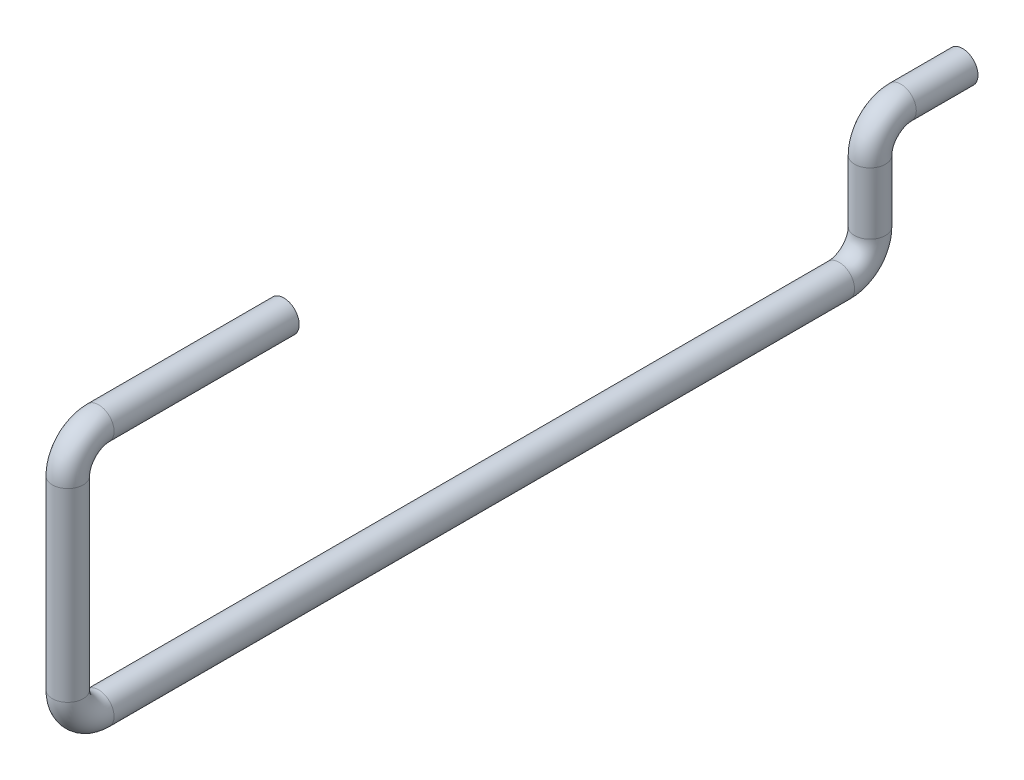
ISO-10303-21;
HEADER;
FILE_DESCRIPTION(('STEP AP214'),'2;1');
FILE_NAME('part.step','',(''),(''),'','','');
FILE_SCHEMA(('AUTOMOTIVE_DESIGN { 1 0 10303 214 1 1 1 1 }'));
ENDSEC;
DATA;
#1=APPLICATION_CONTEXT('core data for automotive mechanical design processes');
#2=APPLICATION_PROTOCOL_DEFINITION('international standard','automotive_design',2000,#1);
#3=PRODUCT_CONTEXT('',#1,'mechanical');
#4=PRODUCT('Part','Part','',(#3));
#5=PRODUCT_RELATED_PRODUCT_CATEGORY('part','',(#4));
#6=PRODUCT_DEFINITION_FORMATION('','',#4);
#7=PRODUCT_DEFINITION_CONTEXT('part definition',#1,'design');
#8=PRODUCT_DEFINITION('design','',#6,#7);
#9=PRODUCT_DEFINITION_SHAPE('','',#8);
#10=(LENGTH_UNIT() NAMED_UNIT(*) SI_UNIT(.MILLI.,.METRE.));
#11=(NAMED_UNIT(*) PLANE_ANGLE_UNIT() SI_UNIT($,.RADIAN.));
#12=(NAMED_UNIT(*) SI_UNIT($,.STERADIAN.) SOLID_ANGLE_UNIT());
#13=UNCERTAINTY_MEASURE_WITH_UNIT(LENGTH_MEASURE(1.E-05),#10,'distance_accuracy_value','');
#14=(GEOMETRIC_REPRESENTATION_CONTEXT(3) GLOBAL_UNCERTAINTY_ASSIGNED_CONTEXT((#13)) GLOBAL_UNIT_ASSIGNED_CONTEXT((#10,
#11,#12)) REPRESENTATION_CONTEXT('',''));
#15=CARTESIAN_POINT('',(0.,0.,0.));
#16=DIRECTION('',(0.,0.,1.));
#17=DIRECTION('',(1.,0.,0.));
#18=AXIS2_PLACEMENT_3D('',#15,#16,#17);
#19=CARTESIAN_POINT('',(0.,4.,-16.));
#20=DIRECTION('',(0.,0.,1.));
#21=DIRECTION('',(1.,0.,0.));
#22=AXIS2_PLACEMENT_3D('',#19,#20,#21);
#23=PLANE('',#22);
#24=CARTESIAN_POINT('',(0.,4.,-16.));
#25=DIRECTION('',(0.,0.,1.));
#26=DIRECTION('',(1.,0.,0.));
#27=AXIS2_PLACEMENT_3D('',#24,#25,#26);
#28=CIRCLE('',#27,0.5);
#29=CARTESIAN_POINT('',(0.5,4.,-16.));
#30=VERTEX_POINT('',#29);
#31=EDGE_CURVE('E69',#30,#30,#28,.T.);
#32=ORIENTED_EDGE('',*,*,#31,.F.);
#33=EDGE_LOOP('',(#32));
#34=FACE_BOUND('',#33,.T.);
#35=ADVANCED_FACE('F35',(#34),#23,.F.);
#36=CARTESIAN_POINT('',(0.,8.,6.));
#37=DIRECTION('',(0.,0.,-1.));
#38=DIRECTION('',(1.,0.,0.));
#39=AXIS2_PLACEMENT_3D('',#36,#37,#38);
#40=PLANE('',#39);
#41=CARTESIAN_POINT('',(0.,8.,6.));
#42=DIRECTION('',(0.,0.,-1.));
#43=DIRECTION('',(1.,0.,0.));
#44=AXIS2_PLACEMENT_3D('',#41,#42,#43);
#45=CIRCLE('',#44,0.5);
#46=CARTESIAN_POINT('',(0.5,8.,6.));
#47=VERTEX_POINT('',#46);
#48=EDGE_CURVE('E10',#47,#47,#45,.T.);
#49=ORIENTED_EDGE('',*,*,#48,.T.);
#50=EDGE_LOOP('',(#49));
#51=FACE_BOUND('',#50,.T.);
#52=ADVANCED_FACE('F76',(#51),#40,.T.);
#53=CARTESIAN_POINT('',(0.,4.,-16.));
#54=DIRECTION('',(0.,0.,1.));
#55=DIRECTION('',(0.,-1.,0.));
#56=AXIS2_PLACEMENT_3D('',#53,#54,#55);
#57=CYLINDRICAL_SURFACE('',#56,0.5);
#58=CARTESIAN_POINT('',(0.,4.,-14.));
#59=DIRECTION('',(0.,0.,1.));
#60=DIRECTION('',(1.,0.,0.));
#61=AXIS2_PLACEMENT_3D('',#58,#59,#60);
#62=CIRCLE('',#61,0.5);
#63=CARTESIAN_POINT('',(0.,4.5,-14.));
#64=VERTEX_POINT('',#63);
#65=EDGE_CURVE('E66',#64,#64,#62,.T.);
#66=ORIENTED_EDGE('',*,*,#65,.F.);
#67=EDGE_LOOP('',(#66));
#68=FACE_BOUND('',#67,.T.);
#69=ORIENTED_EDGE('',*,*,#31,.T.);
#70=EDGE_LOOP('',(#69));
#71=FACE_BOUND('',#70,.T.);
#72=ADVANCED_FACE('F73',(#68,#71),#57,.T.);
#73=CARTESIAN_POINT('',(0.,3.,-14.));
#74=DIRECTION('',(1.,0.,0.));
#75=DIRECTION('',(0.,0.,-1.));
#76=AXIS2_PLACEMENT_3D('',#73,#74,#75);
#77=TOROIDAL_SURFACE('',#76,1.,0.5);
#78=CARTESIAN_POINT('',(0.,3.,-13.));
#79=DIRECTION('',(0.,-1.,0.));
#80=DIRECTION('',(1.,0.,0.));
#81=AXIS2_PLACEMENT_3D('',#78,#79,#80);
#82=CIRCLE('',#81,0.5);
#83=CARTESIAN_POINT('',(0.,3.,-12.5));
#84=VERTEX_POINT('',#83);
#85=EDGE_CURVE('E63',#84,#84,#82,.T.);
#86=CARTESIAN_POINT('',(0.,3.,-14.));
#87=DIRECTION('',(1.,0.,0.));
#88=DIRECTION('',(0.,0.,-1.));
#89=AXIS2_PLACEMENT_3D('',#86,#87,#88);
#90=CIRCLE('',#89,1.5);
#91=EDGE_CURVE('',#64,#84,#90,.T.);
#92=ORIENTED_EDGE('',*,*,#65,.T.);
#93=ORIENTED_EDGE('',*,*,#85,.F.);
#94=ORIENTED_EDGE('',*,*,#91,.T.);
#95=ORIENTED_EDGE('',*,*,#91,.F.);
#96=EDGE_LOOP('',(#92,#94,#93,#95));
#97=FACE_BOUND('',#96,.T.);
#98=ADVANCED_FACE('F110',(#97),#77,.T.);
#99=CARTESIAN_POINT('',(0.,3.,-13.));
#100=DIRECTION('',(0.,-1.,0.));
#101=DIRECTION('',(0.,0.,-1.));
#102=AXIS2_PLACEMENT_3D('',#99,#100,#101);
#103=CYLINDRICAL_SURFACE('',#102,0.5);
#104=CARTESIAN_POINT('',(0.,1.,-13.));
#105=DIRECTION('',(0.,-1.,0.));
#106=DIRECTION('',(1.,0.,0.));
#107=AXIS2_PLACEMENT_3D('',#104,#105,#106);
#108=CIRCLE('',#107,0.5);
#109=CARTESIAN_POINT('',(0.,1.,-13.5));
#110=VERTEX_POINT('',#109);
#111=EDGE_CURVE('E60',#110,#110,#108,.T.);
#112=ORIENTED_EDGE('',*,*,#111,.F.);
#113=EDGE_LOOP('',(#112));
#114=FACE_BOUND('',#113,.T.);
#115=ORIENTED_EDGE('',*,*,#85,.T.);
#116=EDGE_LOOP('',(#115));
#117=FACE_BOUND('',#116,.T.);
#118=ADVANCED_FACE('F106',(#114,#117),#103,.T.);
#119=CARTESIAN_POINT('',(0.,1.,-12.));
#120=DIRECTION('',(-1.,0.,0.));
#121=DIRECTION('',(0.,0.,1.));
#122=AXIS2_PLACEMENT_3D('',#119,#120,#121);
#123=TOROIDAL_SURFACE('',#122,1.,0.5);
#124=CARTESIAN_POINT('',(0.,0.,-12.));
#125=DIRECTION('',(0.,0.,1.));
#126=DIRECTION('',(1.,0.,0.));
#127=AXIS2_PLACEMENT_3D('',#124,#125,#126);
#128=CIRCLE('',#127,0.5);
#129=CARTESIAN_POINT('',(0.,-0.5,-12.));
#130=VERTEX_POINT('',#129);
#131=EDGE_CURVE('E57',#130,#130,#128,.T.);
#132=CARTESIAN_POINT('',(0.,1.,-12.));
#133=DIRECTION('',(-1.,0.,0.));
#134=DIRECTION('',(0.,0.,1.));
#135=AXIS2_PLACEMENT_3D('',#132,#133,#134);
#136=CIRCLE('',#135,1.5);
#137=EDGE_CURVE('',#110,#130,#136,.T.);
#138=ORIENTED_EDGE('',*,*,#111,.T.);
#139=ORIENTED_EDGE('',*,*,#131,.F.);
#140=ORIENTED_EDGE('',*,*,#137,.T.);
#141=ORIENTED_EDGE('',*,*,#137,.F.);
#142=EDGE_LOOP('',(#138,#140,#139,#141));
#143=FACE_BOUND('',#142,.T.);
#144=ADVANCED_FACE('F102',(#143),#123,.T.);
#145=CARTESIAN_POINT('',(0.,0.,-12.));
#146=DIRECTION('',(0.,0.,1.));
#147=DIRECTION('',(0.,-1.,0.));
#148=AXIS2_PLACEMENT_3D('',#145,#146,#147);
#149=CYLINDRICAL_SURFACE('',#148,0.5);
#150=CARTESIAN_POINT('',(0.,0.,12.));
#151=DIRECTION('',(0.,0.,1.));
#152=DIRECTION('',(1.,0.,0.));
#153=AXIS2_PLACEMENT_3D('',#150,#151,#152);
#154=CIRCLE('',#153,0.5);
#155=CARTESIAN_POINT('',(0.,-0.5,12.));
#156=VERTEX_POINT('',#155);
#157=EDGE_CURVE('E54',#156,#156,#154,.T.);
#158=ORIENTED_EDGE('',*,*,#157,.F.);
#159=EDGE_LOOP('',(#158));
#160=FACE_BOUND('',#159,.T.);
#161=ORIENTED_EDGE('',*,*,#131,.T.);
#162=EDGE_LOOP('',(#161));
#163=FACE_BOUND('',#162,.T.);
#164=ADVANCED_FACE('F98',(#160,#163),#149,.T.);
#165=CARTESIAN_POINT('',(0.,1.,12.));
#166=DIRECTION('',(-1.,0.,0.));
#167=DIRECTION('',(0.,0.,1.));
#168=AXIS2_PLACEMENT_3D('',#165,#166,#167);
#169=TOROIDAL_SURFACE('',#168,1.,0.5);
#170=CARTESIAN_POINT('',(0.,1.,13.));
#171=DIRECTION('',(0.,1.,0.));
#172=DIRECTION('',(1.,0.,0.));
#173=AXIS2_PLACEMENT_3D('',#170,#171,#172);
#174=CIRCLE('',#173,0.5);
#175=CARTESIAN_POINT('',(0.,1.,13.5));
#176=VERTEX_POINT('',#175);
#177=EDGE_CURVE('E49',#176,#176,#174,.T.);
#178=CARTESIAN_POINT('',(0.,1.,12.));
#179=DIRECTION('',(-1.,0.,0.));
#180=DIRECTION('',(0.,0.,1.));
#181=AXIS2_PLACEMENT_3D('',#178,#179,#180);
#182=CIRCLE('',#181,1.5);
#183=EDGE_CURVE('',#156,#176,#182,.T.);
#184=ORIENTED_EDGE('',*,*,#157,.T.);
#185=ORIENTED_EDGE('',*,*,#177,.F.);
#186=ORIENTED_EDGE('',*,*,#183,.T.);
#187=ORIENTED_EDGE('',*,*,#183,.F.);
#188=EDGE_LOOP('',(#184,#186,#185,#187));
#189=FACE_BOUND('',#188,.T.);
#190=ADVANCED_FACE('F94',(#189),#169,.T.);
#191=CARTESIAN_POINT('',(0.,1.,13.));
#192=DIRECTION('',(0.,1.,0.));
#193=DIRECTION('',(0.,0.,1.));
#194=AXIS2_PLACEMENT_3D('',#191,#192,#193);
#195=CYLINDRICAL_SURFACE('',#194,0.5);
#196=CARTESIAN_POINT('',(0.,7.,13.));
#197=DIRECTION('',(0.,1.,0.));
#198=DIRECTION('',(1.,0.,0.));
#199=AXIS2_PLACEMENT_3D('',#196,#197,#198);
#200=CIRCLE('',#199,0.5);
#201=CARTESIAN_POINT('',(0.,7.,13.5));
#202=VERTEX_POINT('',#201);
#203=EDGE_CURVE('E45',#202,#202,#200,.T.);
#204=ORIENTED_EDGE('',*,*,#203,.F.);
#205=EDGE_LOOP('',(#204));
#206=FACE_BOUND('',#205,.T.);
#207=ORIENTED_EDGE('',*,*,#177,.T.);
#208=EDGE_LOOP('',(#207));
#209=FACE_BOUND('',#208,.T.);
#210=ADVANCED_FACE('F88',(#206,#209),#195,.T.);
#211=CARTESIAN_POINT('',(0.,7.,12.));
#212=DIRECTION('',(-1.,0.,0.));
#213=DIRECTION('',(0.,0.,1.));
#214=AXIS2_PLACEMENT_3D('',#211,#212,#213);
#215=TOROIDAL_SURFACE('',#214,1.,0.5);
#216=CARTESIAN_POINT('',(0.,8.,12.));
#217=DIRECTION('',(0.,0.,-1.));
#218=DIRECTION('',(1.,0.,0.));
#219=AXIS2_PLACEMENT_3D('',#216,#217,#218);
#220=CIRCLE('',#219,0.5);
#221=CARTESIAN_POINT('',(0.,8.5,12.));
#222=VERTEX_POINT('',#221);
#223=EDGE_CURVE('E41',#222,#222,#220,.T.);
#224=CARTESIAN_POINT('',(0.,7.,12.));
#225=DIRECTION('',(-1.,0.,0.));
#226=DIRECTION('',(0.,0.,1.));
#227=AXIS2_PLACEMENT_3D('',#224,#225,#226);
#228=CIRCLE('',#227,1.5);
#229=EDGE_CURVE('',#202,#222,#228,.T.);
#230=ORIENTED_EDGE('',*,*,#203,.T.);
#231=ORIENTED_EDGE('',*,*,#223,.F.);
#232=ORIENTED_EDGE('',*,*,#229,.T.);
#233=ORIENTED_EDGE('',*,*,#229,.F.);
#234=EDGE_LOOP('',(#230,#232,#231,#233));
#235=FACE_BOUND('',#234,.T.);
#236=ADVANCED_FACE('F82',(#235),#215,.T.);
#237=CARTESIAN_POINT('',(0.,8.,12.));
#238=DIRECTION('',(0.,0.,-1.));
#239=DIRECTION('',(-1.,0.,0.));
#240=AXIS2_PLACEMENT_3D('',#237,#238,#239);
#241=CYLINDRICAL_SURFACE('',#240,0.5);
#242=ORIENTED_EDGE('',*,*,#48,.F.);
#243=EDGE_LOOP('',(#242));
#244=FACE_BOUND('',#243,.T.);
#245=ORIENTED_EDGE('',*,*,#223,.T.);
#246=EDGE_LOOP('',(#245));
#247=FACE_BOUND('',#246,.T.);
#248=ADVANCED_FACE('F80',(#244,#247),#241,.T.);
#249=CLOSED_SHELL('',(#35,#52,#72,#98,#118,#144,#164,#190,#210,#236,#248));
#250=MANIFOLD_SOLID_BREP('B2',#249);
#251=ADVANCED_BREP_SHAPE_REPRESENTATION('',(#18,#250),#14);
#252=SHAPE_DEFINITION_REPRESENTATION(#9,#251);
ENDSEC;
END-ISO-10303-21;
